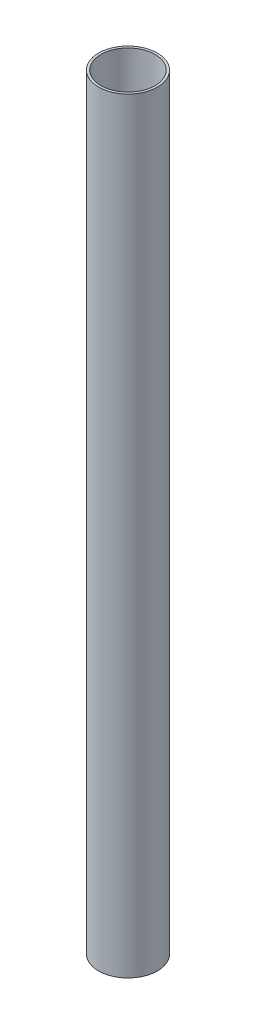
ISO-10303-21;
HEADER;
FILE_DESCRIPTION(('STEP AP214'),'2;1');
FILE_NAME('part.step','',(''),(''),'','','');
FILE_SCHEMA(('AUTOMOTIVE_DESIGN { 1 0 10303 214 1 1 1 1 }'));
ENDSEC;
DATA;
#1=APPLICATION_CONTEXT('core data for automotive mechanical design processes');
#2=APPLICATION_PROTOCOL_DEFINITION('international standard','automotive_design',2000,#1);
#3=PRODUCT_CONTEXT('',#1,'mechanical');
#4=PRODUCT('Part','Part','',(#3));
#5=PRODUCT_RELATED_PRODUCT_CATEGORY('part','',(#4));
#6=PRODUCT_DEFINITION_FORMATION('','',#4);
#7=PRODUCT_DEFINITION_CONTEXT('part definition',#1,'design');
#8=PRODUCT_DEFINITION('design','',#6,#7);
#9=PRODUCT_DEFINITION_SHAPE('','',#8);
#10=(LENGTH_UNIT() NAMED_UNIT(*) SI_UNIT(.MILLI.,.METRE.));
#11=(NAMED_UNIT(*) PLANE_ANGLE_UNIT() SI_UNIT($,.RADIAN.));
#12=(NAMED_UNIT(*) SI_UNIT($,.STERADIAN.) SOLID_ANGLE_UNIT());
#13=UNCERTAINTY_MEASURE_WITH_UNIT(LENGTH_MEASURE(1.E-05),#10,'distance_accuracy_value','');
#14=(GEOMETRIC_REPRESENTATION_CONTEXT(3) GLOBAL_UNCERTAINTY_ASSIGNED_CONTEXT((#13)) GLOBAL_UNIT_ASSIGNED_CONTEXT((#10,
#11,#12)) REPRESENTATION_CONTEXT('',''));
#15=CARTESIAN_POINT('',(0.,0.,0.));
#16=DIRECTION('',(0.,0.,1.));
#17=DIRECTION('',(1.,0.,0.));
#18=AXIS2_PLACEMENT_3D('',#15,#16,#17);
#19=CARTESIAN_POINT('',(0.,650.,0.));
#20=DIRECTION('',(0.,1.,0.));
#21=DIRECTION('',(0.,0.,1.));
#22=AXIS2_PLACEMENT_3D('',#19,#20,#21);
#23=PLANE('',#22);
#24=CARTESIAN_POINT('',(0.,650.,0.));
#25=DIRECTION('',(0.,1.,0.));
#26=DIRECTION('',(0.,0.,1.));
#27=AXIS2_PLACEMENT_3D('',#24,#25,#26);
#28=CIRCLE('',#27,25.);
#29=CARTESIAN_POINT('',(0.,650.,25.));
#30=VERTEX_POINT('',#29);
#31=EDGE_CURVE('E10',#30,#30,#28,.T.);
#32=ORIENTED_EDGE('',*,*,#31,.T.);
#33=EDGE_LOOP('',(#32));
#34=FACE_BOUND('',#33,.T.);
#35=CARTESIAN_POINT('',(0.,650.,0.));
#36=DIRECTION('',(0.,1.,0.));
#37=DIRECTION('',(0.,0.,1.));
#38=AXIS2_PLACEMENT_3D('',#35,#36,#37);
#39=CIRCLE('',#38,23.);
#40=CARTESIAN_POINT('',(0.,650.,23.));
#41=VERTEX_POINT('',#40);
#42=EDGE_CURVE('E43',#41,#41,#39,.T.);
#43=ORIENTED_EDGE('',*,*,#42,.F.);
#44=EDGE_LOOP('',(#43));
#45=FACE_BOUND('',#44,.T.);
#46=ADVANCED_FACE('F32',(#34,#45),#23,.T.);
#47=CARTESIAN_POINT('',(0.,0.,0.));
#48=DIRECTION('',(0.,1.,0.));
#49=DIRECTION('',(0.,0.,1.));
#50=AXIS2_PLACEMENT_3D('',#47,#48,#49);
#51=PLANE('',#50);
#52=CARTESIAN_POINT('',(0.,0.,0.));
#53=DIRECTION('',(0.,1.,0.));
#54=DIRECTION('',(0.,0.,1.));
#55=AXIS2_PLACEMENT_3D('',#52,#53,#54);
#56=CIRCLE('',#55,25.);
#57=CARTESIAN_POINT('',(0.,0.,25.));
#58=VERTEX_POINT('',#57);
#59=EDGE_CURVE('E36',#58,#58,#56,.T.);
#60=ORIENTED_EDGE('',*,*,#59,.F.);
#61=EDGE_LOOP('',(#60));
#62=FACE_BOUND('',#61,.T.);
#63=CARTESIAN_POINT('',(0.,0.,0.));
#64=DIRECTION('',(0.,1.,0.));
#65=DIRECTION('',(0.,0.,1.));
#66=AXIS2_PLACEMENT_3D('',#63,#64,#65);
#67=CIRCLE('',#66,23.);
#68=CARTESIAN_POINT('',(0.,0.,23.));
#69=VERTEX_POINT('',#68);
#70=EDGE_CURVE('E45',#69,#69,#67,.T.);
#71=ORIENTED_EDGE('',*,*,#70,.T.);
#72=EDGE_LOOP('',(#71));
#73=FACE_BOUND('',#72,.T.);
#74=ADVANCED_FACE('F55',(#62,#73),#51,.F.);
#75=CARTESIAN_POINT('',(0.,650.,0.));
#76=DIRECTION('',(0.,-1.,0.));
#77=DIRECTION('',(0.,0.,-1.));
#78=AXIS2_PLACEMENT_3D('',#75,#76,#77);
#79=CYLINDRICAL_SURFACE('',#78,25.);
#80=ORIENTED_EDGE('',*,*,#31,.F.);
#81=EDGE_LOOP('',(#80));
#82=FACE_BOUND('',#81,.T.);
#83=ORIENTED_EDGE('',*,*,#59,.T.);
#84=EDGE_LOOP('',(#83));
#85=FACE_BOUND('',#84,.T.);
#86=ADVANCED_FACE('F34',(#82,#85),#79,.T.);
#87=CARTESIAN_POINT('',(0.,650.,0.));
#88=DIRECTION('',(0.,-1.,0.));
#89=DIRECTION('',(0.,0.,-1.));
#90=AXIS2_PLACEMENT_3D('',#87,#88,#89);
#91=CYLINDRICAL_SURFACE('',#90,23.);
#92=ORIENTED_EDGE('',*,*,#42,.T.);
#93=EDGE_LOOP('',(#92));
#94=FACE_BOUND('',#93,.T.);
#95=ORIENTED_EDGE('',*,*,#70,.F.);
#96=EDGE_LOOP('',(#95));
#97=FACE_BOUND('',#96,.T.);
#98=ADVANCED_FACE('F51',(#94,#97),#91,.F.);
#99=CLOSED_SHELL('',(#46,#74,#86,#98));
#100=MANIFOLD_SOLID_BREP('B2',#99);
#101=ADVANCED_BREP_SHAPE_REPRESENTATION('',(#18,#100),#14);
#102=SHAPE_DEFINITION_REPRESENTATION(#9,#101);
ENDSEC;
END-ISO-10303-21;
